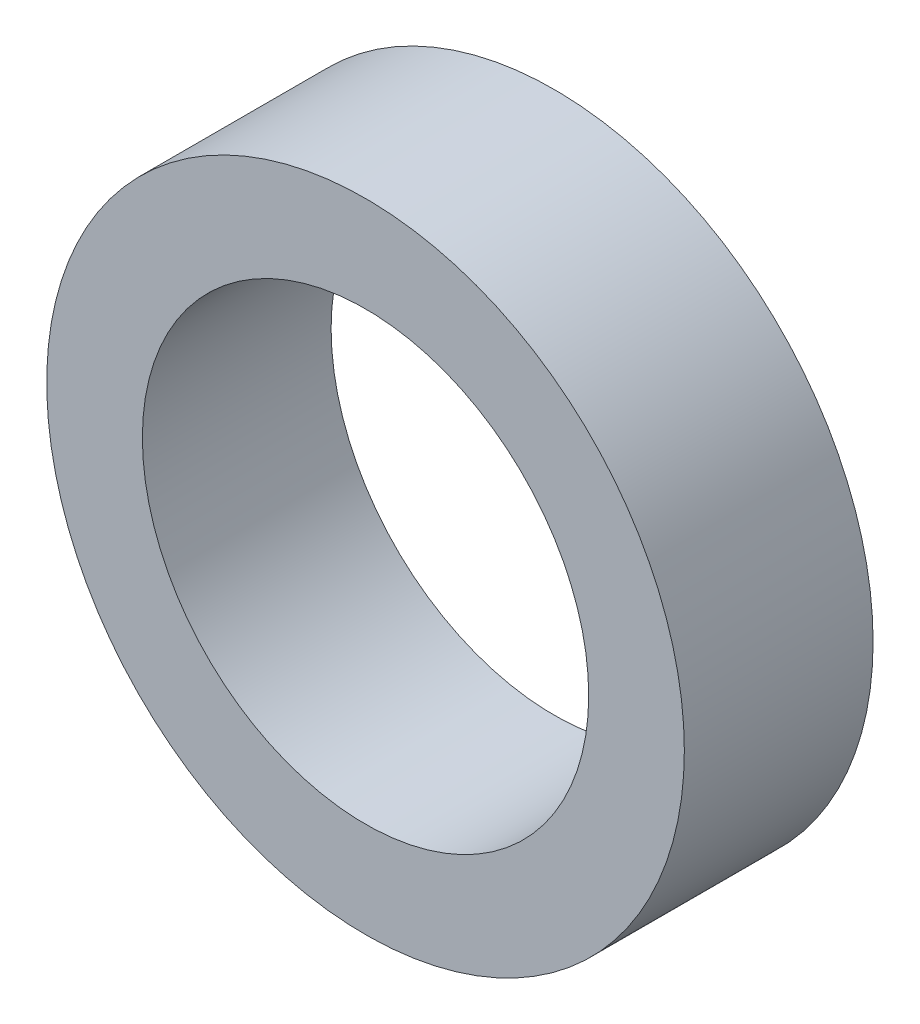
ISO-10303-21;
HEADER;
FILE_DESCRIPTION(('STEP AP214'),'2;1');
FILE_NAME('part.step','',(''),(''),'','','');
FILE_SCHEMA(('AUTOMOTIVE_DESIGN { 1 0 10303 214 1 1 1 1 }'));
ENDSEC;
DATA;
#1=APPLICATION_CONTEXT('core data for automotive mechanical design processes');
#2=APPLICATION_PROTOCOL_DEFINITION('international standard','automotive_design',2000,#1);
#3=PRODUCT_CONTEXT('',#1,'mechanical');
#4=PRODUCT('Part','Part','',(#3));
#5=PRODUCT_RELATED_PRODUCT_CATEGORY('part','',(#4));
#6=PRODUCT_DEFINITION_FORMATION('','',#4);
#7=PRODUCT_DEFINITION_CONTEXT('part definition',#1,'design');
#8=PRODUCT_DEFINITION('design','',#6,#7);
#9=PRODUCT_DEFINITION_SHAPE('','',#8);
#10=(LENGTH_UNIT() NAMED_UNIT(*) SI_UNIT(.MILLI.,.METRE.));
#11=(NAMED_UNIT(*) PLANE_ANGLE_UNIT() SI_UNIT($,.RADIAN.));
#12=(NAMED_UNIT(*) SI_UNIT($,.STERADIAN.) SOLID_ANGLE_UNIT());
#13=UNCERTAINTY_MEASURE_WITH_UNIT(LENGTH_MEASURE(1.E-05),#10,'distance_accuracy_value','');
#14=(GEOMETRIC_REPRESENTATION_CONTEXT(3) GLOBAL_UNCERTAINTY_ASSIGNED_CONTEXT((#13)) GLOBAL_UNIT_ASSIGNED_CONTEXT((#10,
#11,#12)) REPRESENTATION_CONTEXT('',''));
#15=CARTESIAN_POINT('',(0.,0.,0.));
#16=DIRECTION('',(0.,0.,1.));
#17=DIRECTION('',(1.,0.,0.));
#18=AXIS2_PLACEMENT_3D('',#15,#16,#17);
#19=CARTESIAN_POINT('',(0.,0.,4.699));
#20=DIRECTION('',(0.,0.,1.));
#21=DIRECTION('',(1.,0.,0.));
#22=AXIS2_PLACEMENT_3D('',#19,#20,#21);
#23=PLANE('',#22);
#24=CARTESIAN_POINT('',(0.,0.,4.699));
#25=DIRECTION('',(0.,0.,1.));
#26=DIRECTION('',(1.,0.,0.));
#27=AXIS2_PLACEMENT_3D('',#24,#25,#26);
#28=CIRCLE('',#27,15.875);
#29=CARTESIAN_POINT('',(15.875,0.,4.699));
#30=VERTEX_POINT('',#29);
#31=EDGE_CURVE('E10',#30,#30,#28,.T.);
#32=ORIENTED_EDGE('',*,*,#31,.T.);
#33=EDGE_LOOP('',(#32));
#34=FACE_BOUND('',#33,.T.);
#35=CARTESIAN_POINT('',(0.,0.,4.699));
#36=DIRECTION('',(0.,0.,1.));
#37=DIRECTION('',(1.,0.,0.));
#38=AXIS2_PLACEMENT_3D('',#35,#36,#37);
#39=CIRCLE('',#38,11.1125);
#40=CARTESIAN_POINT('',(11.1125,0.,4.699));
#41=VERTEX_POINT('',#40);
#42=EDGE_CURVE('E42',#41,#41,#39,.T.);
#43=ORIENTED_EDGE('',*,*,#42,.F.);
#44=EDGE_LOOP('',(#43));
#45=FACE_BOUND('',#44,.T.);
#46=ADVANCED_FACE('F31',(#34,#45),#23,.T.);
#47=CARTESIAN_POINT('',(0.,0.,-4.699));
#48=DIRECTION('',(0.,0.,1.));
#49=DIRECTION('',(1.,0.,0.));
#50=AXIS2_PLACEMENT_3D('',#47,#48,#49);
#51=PLANE('',#50);
#52=CARTESIAN_POINT('',(0.,0.,-4.699));
#53=DIRECTION('',(0.,0.,1.));
#54=DIRECTION('',(1.,0.,0.));
#55=AXIS2_PLACEMENT_3D('',#52,#53,#54);
#56=CIRCLE('',#55,15.875);
#57=CARTESIAN_POINT('',(15.875,0.,-4.699));
#58=VERTEX_POINT('',#57);
#59=EDGE_CURVE('E35',#58,#58,#56,.T.);
#60=ORIENTED_EDGE('',*,*,#59,.F.);
#61=EDGE_LOOP('',(#60));
#62=FACE_BOUND('',#61,.T.);
#63=CARTESIAN_POINT('',(0.,0.,-4.699));
#64=DIRECTION('',(0.,0.,1.));
#65=DIRECTION('',(1.,0.,0.));
#66=AXIS2_PLACEMENT_3D('',#63,#64,#65);
#67=CIRCLE('',#66,11.1125);
#68=CARTESIAN_POINT('',(11.1125,0.,-4.699));
#69=VERTEX_POINT('',#68);
#70=EDGE_CURVE('E44',#69,#69,#67,.T.);
#71=ORIENTED_EDGE('',*,*,#70,.T.);
#72=EDGE_LOOP('',(#71));
#73=FACE_BOUND('',#72,.T.);
#74=ADVANCED_FACE('F54',(#62,#73),#51,.F.);
#75=CARTESIAN_POINT('',(0.,0.,4.699));
#76=DIRECTION('',(0.,0.,-1.));
#77=DIRECTION('',(-1.,0.,0.));
#78=AXIS2_PLACEMENT_3D('',#75,#76,#77);
#79=CYLINDRICAL_SURFACE('',#78,15.875);
#80=ORIENTED_EDGE('',*,*,#31,.F.);
#81=EDGE_LOOP('',(#80));
#82=FACE_BOUND('',#81,.T.);
#83=ORIENTED_EDGE('',*,*,#59,.T.);
#84=EDGE_LOOP('',(#83));
#85=FACE_BOUND('',#84,.T.);
#86=ADVANCED_FACE('F33',(#82,#85),#79,.T.);
#87=CARTESIAN_POINT('',(0.,0.,4.699));
#88=DIRECTION('',(0.,0.,-1.));
#89=DIRECTION('',(-1.,0.,0.));
#90=AXIS2_PLACEMENT_3D('',#87,#88,#89);
#91=CYLINDRICAL_SURFACE('',#90,11.1125);
#92=ORIENTED_EDGE('',*,*,#42,.T.);
#93=EDGE_LOOP('',(#92));
#94=FACE_BOUND('',#93,.T.);
#95=ORIENTED_EDGE('',*,*,#70,.F.);
#96=EDGE_LOOP('',(#95));
#97=FACE_BOUND('',#96,.T.);
#98=ADVANCED_FACE('F50',(#94,#97),#91,.F.);
#99=CLOSED_SHELL('',(#46,#74,#86,#98));
#100=MANIFOLD_SOLID_BREP('B2',#99);
#101=ADVANCED_BREP_SHAPE_REPRESENTATION('',(#18,#100),#14);
#102=SHAPE_DEFINITION_REPRESENTATION(#9,#101);
ENDSEC;
END-ISO-10303-21;
